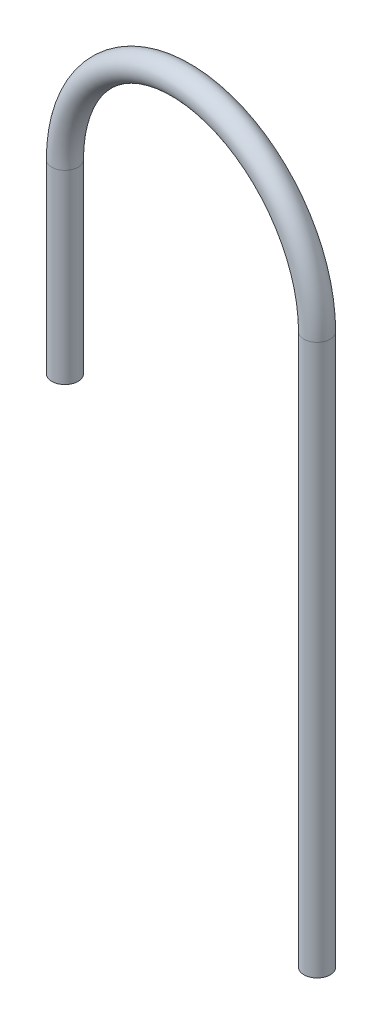
ISO-10303-21;
HEADER;
FILE_DESCRIPTION(('STEP AP214'),'2;1');
FILE_NAME('part.step','',(''),(''),'','','');
FILE_SCHEMA(('AUTOMOTIVE_DESIGN { 1 0 10303 214 1 1 1 1 }'));
ENDSEC;
DATA;
#1=APPLICATION_CONTEXT('core data for automotive mechanical design processes');
#2=APPLICATION_PROTOCOL_DEFINITION('international standard','automotive_design',2000,#1);
#3=PRODUCT_CONTEXT('',#1,'mechanical');
#4=PRODUCT('Part','Part','',(#3));
#5=PRODUCT_RELATED_PRODUCT_CATEGORY('part','',(#4));
#6=PRODUCT_DEFINITION_FORMATION('','',#4);
#7=PRODUCT_DEFINITION_CONTEXT('part definition',#1,'design');
#8=PRODUCT_DEFINITION('design','',#6,#7);
#9=PRODUCT_DEFINITION_SHAPE('','',#8);
#10=(LENGTH_UNIT() NAMED_UNIT(*) SI_UNIT(.MILLI.,.METRE.));
#11=(NAMED_UNIT(*) PLANE_ANGLE_UNIT() SI_UNIT($,.RADIAN.));
#12=(NAMED_UNIT(*) SI_UNIT($,.STERADIAN.) SOLID_ANGLE_UNIT());
#13=UNCERTAINTY_MEASURE_WITH_UNIT(LENGTH_MEASURE(1.E-05),#10,'distance_accuracy_value','');
#14=(GEOMETRIC_REPRESENTATION_CONTEXT(3) GLOBAL_UNCERTAINTY_ASSIGNED_CONTEXT((#13)) GLOBAL_UNIT_ASSIGNED_CONTEXT((#10,
#11,#12)) REPRESENTATION_CONTEXT('',''));
#15=CARTESIAN_POINT('',(0.,0.,0.));
#16=DIRECTION('',(0.,0.,1.));
#17=DIRECTION('',(1.,0.,0.));
#18=AXIS2_PLACEMENT_3D('',#15,#16,#17);
#19=CARTESIAN_POINT('',(14.,165.,-59.25));
#20=DIRECTION('',(0.,-1.,0.));
#21=DIRECTION('',(-0.165120370379967,0.,0.986273422173376));
#22=AXIS2_PLACEMENT_3D('',#19,#20,#21);
#23=PLANE('',#22);
#24=CARTESIAN_POINT('',(14.,165.,-59.25));
#25=DIRECTION('',(0.,-1.,0.));
#26=DIRECTION('',(0.,0.,-1.));
#27=AXIS2_PLACEMENT_3D('',#24,#25,#26);
#28=CIRCLE('',#27,2.);
#29=CARTESIAN_POINT('',(14.,165.,-61.25));
#30=VERTEX_POINT('',#29);
#31=EDGE_CURVE('E66',#30,#30,#28,.T.);
#32=ORIENTED_EDGE('',*,*,#31,.F.);
#33=EDGE_LOOP('',(#32));
#34=FACE_BOUND('',#33,.T.);
#35=CARTESIAN_POINT('',(14.,165.,-59.25));
#36=DIRECTION('',(0.,-1.,0.));
#37=DIRECTION('',(-0.165120370379967,0.,0.986273422173376));
#38=AXIS2_PLACEMENT_3D('',#35,#36,#37);
#39=CIRCLE('',#38,3.);
#40=CARTESIAN_POINT('',(13.5046388888601,165.,-56.2911797334799));
#41=VERTEX_POINT('',#40);
#42=EDGE_CURVE('E57',#41,#41,#39,.T.);
#43=ORIENTED_EDGE('',*,*,#42,.T.);
#44=EDGE_LOOP('',(#43));
#45=FACE_BOUND('',#44,.T.);
#46=ADVANCED_FACE('F43',(#34,#45),#23,.T.);
#47=CARTESIAN_POINT('',(76.8149247014594,81.6500000000001,-54.0281491126505));
#48=DIRECTION('',(0.,1.,0.));
#49=DIRECTION('',(0.,0.,1.));
#50=AXIS2_PLACEMENT_3D('',#47,#48,#49);
#51=PLANE('',#50);
#52=CARTESIAN_POINT('',(76.8149247014594,81.6500000000001,-54.0281491126505));
#53=DIRECTION('',(0.,1.,0.));
#54=DIRECTION('',(0.,0.,1.));
#55=AXIS2_PLACEMENT_3D('',#52,#53,#54);
#56=CIRCLE('',#55,2.);
#57=CARTESIAN_POINT('',(76.8149247014594,81.6500000000001,-52.0281491126505));
#58=VERTEX_POINT('',#57);
#59=EDGE_CURVE('E62',#58,#58,#56,.T.);
#60=ORIENTED_EDGE('',*,*,#59,.T.);
#61=EDGE_LOOP('',(#60));
#62=FACE_BOUND('',#61,.T.);
#63=CARTESIAN_POINT('',(76.8149247014594,81.6500000000001,-54.0281491126505));
#64=DIRECTION('',(0.,1.,0.));
#65=DIRECTION('',(0.,0.,1.));
#66=AXIS2_PLACEMENT_3D('',#63,#64,#65);
#67=CIRCLE('',#66,3.);
#68=CARTESIAN_POINT('',(76.8149247014594,81.6500000000001,-51.0281491126505));
#69=VERTEX_POINT('',#68);
#70=EDGE_CURVE('E11',#69,#69,#67,.T.);
#71=ORIENTED_EDGE('',*,*,#70,.F.);
#72=EDGE_LOOP('',(#71));
#73=FACE_BOUND('',#72,.T.);
#74=ADVANCED_FACE('F86',(#62,#73),#51,.F.);
#75=CARTESIAN_POINT('',(14.,165.,-59.25));
#76=DIRECTION('',(0.,1.,0.));
#77=DIRECTION('',(0.,0.,1.));
#78=AXIS2_PLACEMENT_3D('',#75,#76,#77);
#79=CYLINDRICAL_SURFACE('',#78,3.);
#80=CARTESIAN_POINT('',(14.,207.375,-59.25));
#81=DIRECTION('',(0.,-1.,0.));
#82=DIRECTION('',(-0.165120370379967,0.,0.986273422173376));
#83=AXIS2_PLACEMENT_3D('',#80,#81,#82);
#84=CIRCLE('',#83,3.);
#85=CARTESIAN_POINT('',(11.0103126585243,207.375,-59.4985349074472));
#86=VERTEX_POINT('',#85);
#87=EDGE_CURVE('E53',#86,#86,#84,.T.);
#88=ORIENTED_EDGE('',*,*,#87,.T.);
#89=EDGE_LOOP('',(#88));
#90=FACE_BOUND('',#89,.T.);
#91=ORIENTED_EDGE('',*,*,#42,.F.);
#92=EDGE_LOOP('',(#91));
#93=FACE_BOUND('',#92,.T.);
#94=ADVANCED_FACE('F90',(#90,#93),#79,.T.);
#95=CARTESIAN_POINT('',(45.4074623507297,207.375,-56.6390745563253));
#96=DIRECTION('',(0.0828449691490795,0.,-0.996562447158575));
#97=DIRECTION('',(-0.996562447158575,0.,-0.0828449691490795));
#98=AXIS2_PLACEMENT_3D('',#95,#96,#97);
#99=TOROIDAL_SURFACE('',#98,31.5157995771158,3.);
#100=CARTESIAN_POINT('',(76.8149247014594,207.375,-54.0281491126505));
#101=DIRECTION('',(0.,1.,0.));
#102=DIRECTION('',(0.,0.,1.));
#103=AXIS2_PLACEMENT_3D('',#100,#101,#102);
#104=CIRCLE('',#103,3.);
#105=CARTESIAN_POINT('',(79.8046120429352,207.375,-53.7796142052033));
#106=VERTEX_POINT('',#105);
#107=EDGE_CURVE('E49',#106,#106,#104,.T.);
#108=CARTESIAN_POINT('',(45.4074623507297,207.375,-56.6390745563253));
#109=DIRECTION('',(0.0828449691490795,0.,-0.996562447158575));
#110=DIRECTION('',(-0.996562447158575,0.,-0.0828449691490795));
#111=AXIS2_PLACEMENT_3D('',#108,#109,#110);
#112=CIRCLE('',#111,34.5157995771158);
#113=EDGE_CURVE('',#86,#106,#112,.T.);
#114=ORIENTED_EDGE('',*,*,#87,.F.);
#115=ORIENTED_EDGE('',*,*,#107,.T.);
#116=ORIENTED_EDGE('',*,*,#113,.T.);
#117=ORIENTED_EDGE('',*,*,#113,.F.);
#118=EDGE_LOOP('',(#114,#116,#115,#117));
#119=FACE_BOUND('',#118,.T.);
#120=ADVANCED_FACE('F92',(#119),#99,.T.);
#121=CARTESIAN_POINT('',(76.8149247014594,207.375,-54.0281491126505));
#122=DIRECTION('',(0.,-1.,0.));
#123=DIRECTION('',(0.,0.,-1.));
#124=AXIS2_PLACEMENT_3D('',#121,#122,#123);
#125=CYLINDRICAL_SURFACE('',#124,3.);
#126=ORIENTED_EDGE('',*,*,#70,.T.);
#127=EDGE_LOOP('',(#126));
#128=FACE_BOUND('',#127,.T.);
#129=ORIENTED_EDGE('',*,*,#107,.F.);
#130=EDGE_LOOP('',(#129));
#131=FACE_BOUND('',#130,.T.);
#132=ADVANCED_FACE('F80',(#128,#131),#125,.T.);
#133=CARTESIAN_POINT('',(14.,165.,-59.25));
#134=DIRECTION('',(0.,1.,0.));
#135=DIRECTION('',(0.,0.,1.));
#136=AXIS2_PLACEMENT_3D('',#133,#134,#135);
#137=CYLINDRICAL_SURFACE('',#136,2.);
#138=CARTESIAN_POINT('',(14.,207.375,-59.25));
#139=DIRECTION('',(0.,1.,0.));
#140=DIRECTION('',(0.,0.,1.));
#141=AXIS2_PLACEMENT_3D('',#138,#139,#140);
#142=CIRCLE('',#141,2.);
#143=CARTESIAN_POINT('',(12.0068751056828,207.375,-59.4156899382982));
#144=VERTEX_POINT('',#143);
#145=EDGE_CURVE('E69',#144,#144,#142,.F.);
#146=ORIENTED_EDGE('',*,*,#145,.F.);
#147=EDGE_LOOP('',(#146));
#148=FACE_BOUND('',#147,.T.);
#149=ORIENTED_EDGE('',*,*,#31,.T.);
#150=EDGE_LOOP('',(#149));
#151=FACE_BOUND('',#150,.T.);
#152=ADVANCED_FACE('F77',(#148,#151),#137,.F.);
#153=CARTESIAN_POINT('',(45.4074623507297,207.375,-56.6390745563253));
#154=DIRECTION('',(0.0828449691490795,0.,-0.996562447158575));
#155=DIRECTION('',(-0.996562447158575,0.,-0.0828449691490795));
#156=AXIS2_PLACEMENT_3D('',#153,#154,#155);
#157=TOROIDAL_SURFACE('',#156,31.5157995771158,2.);
#158=CARTESIAN_POINT('',(76.8149247014594,207.375,-54.0281491126505));
#159=DIRECTION('',(0.,1.,0.));
#160=DIRECTION('',(-1.,0.,0.));
#161=AXIS2_PLACEMENT_3D('',#158,#159,#160);
#162=CIRCLE('',#161,2.);
#163=CARTESIAN_POINT('',(78.8080495957766,207.375,-53.8624591743524));
#164=VERTEX_POINT('',#163);
#165=EDGE_CURVE('E65',#164,#164,#162,.T.);
#166=CARTESIAN_POINT('',(45.4074623507297,207.375,-56.6390745563253));
#167=DIRECTION('',(0.0828449691490795,0.,-0.996562447158575));
#168=DIRECTION('',(-0.996562447158575,0.,-0.0828449691490795));
#169=AXIS2_PLACEMENT_3D('',#166,#167,#168);
#170=CIRCLE('',#169,33.5157995771158);
#171=EDGE_CURVE('',#144,#164,#170,.T.);
#172=ORIENTED_EDGE('',*,*,#145,.T.);
#173=ORIENTED_EDGE('',*,*,#165,.F.);
#174=ORIENTED_EDGE('',*,*,#171,.T.);
#175=ORIENTED_EDGE('',*,*,#171,.F.);
#176=EDGE_LOOP('',(#172,#174,#173,#175));
#177=FACE_BOUND('',#176,.T.);
#178=ADVANCED_FACE('F75',(#177),#157,.F.);
#179=CARTESIAN_POINT('',(76.8149247014594,207.375,-54.0281491126505));
#180=DIRECTION('',(0.,-1.,0.));
#181=DIRECTION('',(0.,0.,-1.));
#182=AXIS2_PLACEMENT_3D('',#179,#180,#181);
#183=CYLINDRICAL_SURFACE('',#182,2.);
#184=ORIENTED_EDGE('',*,*,#59,.F.);
#185=EDGE_LOOP('',(#184));
#186=FACE_BOUND('',#185,.T.);
#187=ORIENTED_EDGE('',*,*,#165,.T.);
#188=EDGE_LOOP('',(#187));
#189=FACE_BOUND('',#188,.T.);
#190=ADVANCED_FACE('F87',(#186,#189),#183,.F.);
#191=CLOSED_SHELL('',(#46,#74,#94,#120,#132,#152,#178,#190));
#192=MANIFOLD_SOLID_BREP('B2',#191);
#193=ADVANCED_BREP_SHAPE_REPRESENTATION('',(#18,#192),#14);
#194=SHAPE_DEFINITION_REPRESENTATION(#9,#193);
ENDSEC;
END-ISO-10303-21;
